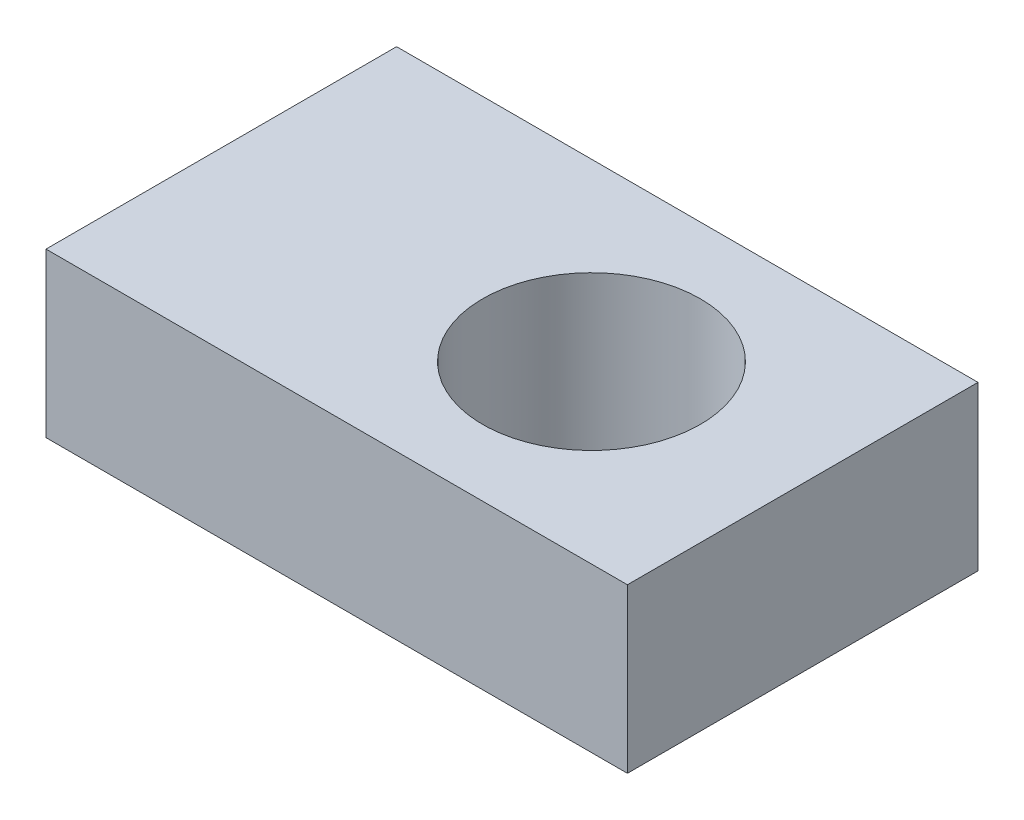
ISO-10303-21;
HEADER;
FILE_DESCRIPTION(('STEP AP214'),'2;1');
FILE_NAME('part.step','',(''),(''),'','','');
FILE_SCHEMA(('AUTOMOTIVE_DESIGN { 1 0 10303 214 1 1 1 1 }'));
ENDSEC;
DATA;
#1=APPLICATION_CONTEXT('core data for automotive mechanical design processes');
#2=APPLICATION_PROTOCOL_DEFINITION('international standard','automotive_design',2000,#1);
#3=PRODUCT_CONTEXT('',#1,'mechanical');
#4=PRODUCT('Part','Part','',(#3));
#5=PRODUCT_RELATED_PRODUCT_CATEGORY('part','',(#4));
#6=PRODUCT_DEFINITION_FORMATION('','',#4);
#7=PRODUCT_DEFINITION_CONTEXT('part definition',#1,'design');
#8=PRODUCT_DEFINITION('design','',#6,#7);
#9=PRODUCT_DEFINITION_SHAPE('','',#8);
#10=(LENGTH_UNIT() NAMED_UNIT(*) SI_UNIT(.MILLI.,.METRE.));
#11=(NAMED_UNIT(*) PLANE_ANGLE_UNIT() SI_UNIT($,.RADIAN.));
#12=(NAMED_UNIT(*) SI_UNIT($,.STERADIAN.) SOLID_ANGLE_UNIT());
#13=UNCERTAINTY_MEASURE_WITH_UNIT(LENGTH_MEASURE(1.E-05),#10,'distance_accuracy_value','');
#14=(GEOMETRIC_REPRESENTATION_CONTEXT(3) GLOBAL_UNCERTAINTY_ASSIGNED_CONTEXT((#13)) GLOBAL_UNIT_ASSIGNED_CONTEXT((#10,
#11,#12)) REPRESENTATION_CONTEXT('',''));
#15=CARTESIAN_POINT('',(0.,0.,0.));
#16=DIRECTION('',(0.,0.,1.));
#17=DIRECTION('',(1.,0.,0.));
#18=AXIS2_PLACEMENT_3D('',#15,#16,#17);
#19=CARTESIAN_POINT('',(2.77,0.02,12.38));
#20=DIRECTION('',(0.,-1.,0.));
#21=DIRECTION('',(0.,0.,-1.));
#22=AXIS2_PLACEMENT_3D('',#19,#20,#21);
#23=PLANE('',#22);
#24=CARTESIAN_POINT('',(3.5,0.0200000000000001,12.38));
#25=DIRECTION('',(0.,-1.,0.));
#26=DIRECTION('',(0.,0.,-1.));
#27=AXIS2_PLACEMENT_3D('',#24,#25,#26);
#28=CIRCLE('',#27,1.);
#29=CARTESIAN_POINT('',(3.5,0.0200000000000001,11.38));
#30=VERTEX_POINT('',#29);
#31=EDGE_CURVE('E20',#30,#30,#28,.F.);
#32=ORIENTED_EDGE('',*,*,#31,.T.);
#33=EDGE_LOOP('',(#32));
#34=FACE_BOUND('',#33,.T.);
#35=DIRECTION('',(-1.,0.,0.));
#36=VECTOR('',#35,1.);
#37=CARTESIAN_POINT('',(0.1,0.0200000000000001,10.77));
#38=LINE('',#37,#36);
#39=CARTESIAN_POINT('',(5.44,0.02,10.77));
#40=VERTEX_POINT('',#39);
#41=CARTESIAN_POINT('',(0.1,0.02,10.77));
#42=VERTEX_POINT('',#41);
#43=EDGE_CURVE('E69',#40,#42,#38,.T.);
#44=ORIENTED_EDGE('',*,*,#43,.F.);
#45=DIRECTION('',(0.,0.,-1.));
#46=VECTOR('',#45,1.);
#47=CARTESIAN_POINT('',(5.44,0.0200000000000001,10.77));
#48=LINE('',#47,#46);
#49=CARTESIAN_POINT('',(5.44,0.02,13.99));
#50=VERTEX_POINT('',#49);
#51=EDGE_CURVE('E54',#50,#40,#48,.T.);
#52=ORIENTED_EDGE('',*,*,#51,.F.);
#53=DIRECTION('',(1.,0.,0.));
#54=VECTOR('',#53,1.);
#55=CARTESIAN_POINT('',(5.44,0.0200000000000001,13.99));
#56=LINE('',#55,#54);
#57=CARTESIAN_POINT('',(0.1,0.02,13.99));
#58=VERTEX_POINT('',#57);
#59=EDGE_CURVE('E59',#58,#50,#56,.T.);
#60=ORIENTED_EDGE('',*,*,#59,.F.);
#61=DIRECTION('',(0.,0.,1.));
#62=VECTOR('',#61,1.);
#63=CARTESIAN_POINT('',(0.1,0.0200000000000001,13.99));
#64=LINE('',#63,#62);
#65=EDGE_CURVE('E82',#42,#58,#64,.T.);
#66=ORIENTED_EDGE('',*,*,#65,.F.);
#67=EDGE_LOOP('',(#44,#52,#60,#66));
#68=FACE_BOUND('',#67,.T.);
#69=ADVANCED_FACE('F17',(#34,#68),#23,.T.);
#70=CARTESIAN_POINT('',(5.44,1.52,13.99));
#71=DIRECTION('',(0.,0.,1.));
#72=DIRECTION('',(1.,0.,0.));
#73=AXIS2_PLACEMENT_3D('',#70,#71,#72);
#74=PLANE('',#73);
#75=ORIENTED_EDGE('',*,*,#59,.T.);
#76=DIRECTION('',(0.,1.,0.));
#77=VECTOR('',#76,1.);
#78=CARTESIAN_POINT('',(5.44,1.52,13.99));
#79=LINE('',#78,#77);
#80=CARTESIAN_POINT('',(5.44,1.52,13.99));
#81=VERTEX_POINT('',#80);
#82=EDGE_CURVE('E61',#81,#50,#79,.F.);
#83=ORIENTED_EDGE('',*,*,#82,.F.);
#84=DIRECTION('',(1.,0.,0.));
#85=VECTOR('',#84,1.);
#86=CARTESIAN_POINT('',(2.77,1.52,13.99));
#87=LINE('',#86,#85);
#88=CARTESIAN_POINT('',(0.1,1.52,13.99));
#89=VERTEX_POINT('',#88);
#90=EDGE_CURVE('E85',#89,#81,#87,.T.);
#91=ORIENTED_EDGE('',*,*,#90,.F.);
#92=DIRECTION('',(0.,1.,0.));
#93=VECTOR('',#92,1.);
#94=CARTESIAN_POINT('',(0.1,1.52,13.99));
#95=LINE('',#94,#93);
#96=EDGE_CURVE('E64',#58,#89,#95,.T.);
#97=ORIENTED_EDGE('',*,*,#96,.F.);
#98=EDGE_LOOP('',(#75,#83,#91,#97));
#99=FACE_BOUND('',#98,.T.);
#100=ADVANCED_FACE('F60',(#99),#74,.T.);
#101=CARTESIAN_POINT('',(5.44,1.52,10.77));
#102=DIRECTION('',(1.,0.,0.));
#103=DIRECTION('',(0.,0.,-1.));
#104=AXIS2_PLACEMENT_3D('',#101,#102,#103);
#105=PLANE('',#104);
#106=ORIENTED_EDGE('',*,*,#51,.T.);
#107=DIRECTION('',(0.,1.,0.));
#108=VECTOR('',#107,1.);
#109=CARTESIAN_POINT('',(5.44,1.52,10.77));
#110=LINE('',#109,#108);
#111=CARTESIAN_POINT('',(5.44,1.52,10.77));
#112=VERTEX_POINT('',#111);
#113=EDGE_CURVE('E71',#112,#40,#110,.F.);
#114=ORIENTED_EDGE('',*,*,#113,.F.);
#115=DIRECTION('',(0.,0.,1.));
#116=VECTOR('',#115,1.);
#117=CARTESIAN_POINT('',(5.44,1.52,12.38));
#118=LINE('',#117,#116);
#119=EDGE_CURVE('E75',#81,#112,#118,.F.);
#120=ORIENTED_EDGE('',*,*,#119,.F.);
#121=ORIENTED_EDGE('',*,*,#82,.T.);
#122=EDGE_LOOP('',(#106,#114,#120,#121));
#123=FACE_BOUND('',#122,.T.);
#124=ADVANCED_FACE('F73',(#123),#105,.T.);
#125=CARTESIAN_POINT('',(0.1,1.52,10.77));
#126=DIRECTION('',(0.,0.,-1.));
#127=DIRECTION('',(-1.,0.,0.));
#128=AXIS2_PLACEMENT_3D('',#125,#126,#127);
#129=PLANE('',#128);
#130=ORIENTED_EDGE('',*,*,#43,.T.);
#131=DIRECTION('',(0.,1.,0.));
#132=VECTOR('',#131,1.);
#133=CARTESIAN_POINT('',(0.1,1.52,10.77));
#134=LINE('',#133,#132);
#135=CARTESIAN_POINT('',(0.1,1.52,10.77));
#136=VERTEX_POINT('',#135);
#137=EDGE_CURVE('E34',#136,#42,#134,.F.);
#138=ORIENTED_EDGE('',*,*,#137,.F.);
#139=DIRECTION('',(1.,0.,0.));
#140=VECTOR('',#139,1.);
#141=CARTESIAN_POINT('',(2.77,1.52,10.77));
#142=LINE('',#141,#140);
#143=EDGE_CURVE('E88',#112,#136,#142,.F.);
#144=ORIENTED_EDGE('',*,*,#143,.F.);
#145=ORIENTED_EDGE('',*,*,#113,.T.);
#146=EDGE_LOOP('',(#130,#138,#144,#145));
#147=FACE_BOUND('',#146,.T.);
#148=ADVANCED_FACE('F98',(#147),#129,.T.);
#149=CARTESIAN_POINT('',(0.1,1.52,13.99));
#150=DIRECTION('',(-1.,0.,0.));
#151=DIRECTION('',(0.,0.,1.));
#152=AXIS2_PLACEMENT_3D('',#149,#150,#151);
#153=PLANE('',#152);
#154=ORIENTED_EDGE('',*,*,#65,.T.);
#155=ORIENTED_EDGE('',*,*,#96,.T.);
#156=DIRECTION('',(0.,0.,1.));
#157=VECTOR('',#156,1.);
#158=CARTESIAN_POINT('',(0.0999999999999998,1.52,12.38));
#159=LINE('',#158,#157);
#160=EDGE_CURVE('E26',#136,#89,#159,.T.);
#161=ORIENTED_EDGE('',*,*,#160,.F.);
#162=ORIENTED_EDGE('',*,*,#137,.T.);
#163=EDGE_LOOP('',(#154,#155,#161,#162));
#164=FACE_BOUND('',#163,.T.);
#165=ADVANCED_FACE('F95',(#164),#153,.T.);
#166=CARTESIAN_POINT('',(3.5,1.52,12.38));
#167=DIRECTION('',(0.,-1.,0.));
#168=DIRECTION('',(0.,0.,-1.));
#169=AXIS2_PLACEMENT_3D('',#166,#167,#168);
#170=CYLINDRICAL_SURFACE('',#169,1.);
#171=ORIENTED_EDGE('',*,*,#31,.F.);
#172=EDGE_LOOP('',(#171));
#173=FACE_BOUND('',#172,.T.);
#174=CARTESIAN_POINT('',(3.5,1.52,12.38));
#175=DIRECTION('',(0.,-1.,0.));
#176=DIRECTION('',(0.,0.,-1.));
#177=AXIS2_PLACEMENT_3D('',#174,#175,#176);
#178=CIRCLE('',#177,1.);
#179=CARTESIAN_POINT('',(3.5,1.52,11.38));
#180=VERTEX_POINT('',#179);
#181=EDGE_CURVE('E11',#180,#180,#178,.T.);
#182=ORIENTED_EDGE('',*,*,#181,.F.);
#183=EDGE_LOOP('',(#182));
#184=FACE_BOUND('',#183,.T.);
#185=ADVANCED_FACE('F97',(#173,#184),#170,.F.);
#186=CARTESIAN_POINT('',(2.77,1.52,12.38));
#187=DIRECTION('',(0.,1.,0.));
#188=DIRECTION('',(0.,0.,1.));
#189=AXIS2_PLACEMENT_3D('',#186,#187,#188);
#190=PLANE('',#189);
#191=ORIENTED_EDGE('',*,*,#181,.T.);
#192=EDGE_LOOP('',(#191));
#193=FACE_BOUND('',#192,.T.);
#194=ORIENTED_EDGE('',*,*,#143,.T.);
#195=ORIENTED_EDGE('',*,*,#160,.T.);
#196=ORIENTED_EDGE('',*,*,#90,.T.);
#197=ORIENTED_EDGE('',*,*,#119,.T.);
#198=EDGE_LOOP('',(#194,#195,#196,#197));
#199=FACE_BOUND('',#198,.T.);
#200=ADVANCED_FACE('F93',(#193,#199),#190,.T.);
#201=CLOSED_SHELL('',(#69,#100,#124,#148,#165,#185,#200));
#202=MANIFOLD_SOLID_BREP('B1',#201);
#203=ADVANCED_BREP_SHAPE_REPRESENTATION('',(#18,#202),#14);
#204=SHAPE_DEFINITION_REPRESENTATION(#9,#203);
ENDSEC;
END-ISO-10303-21;
